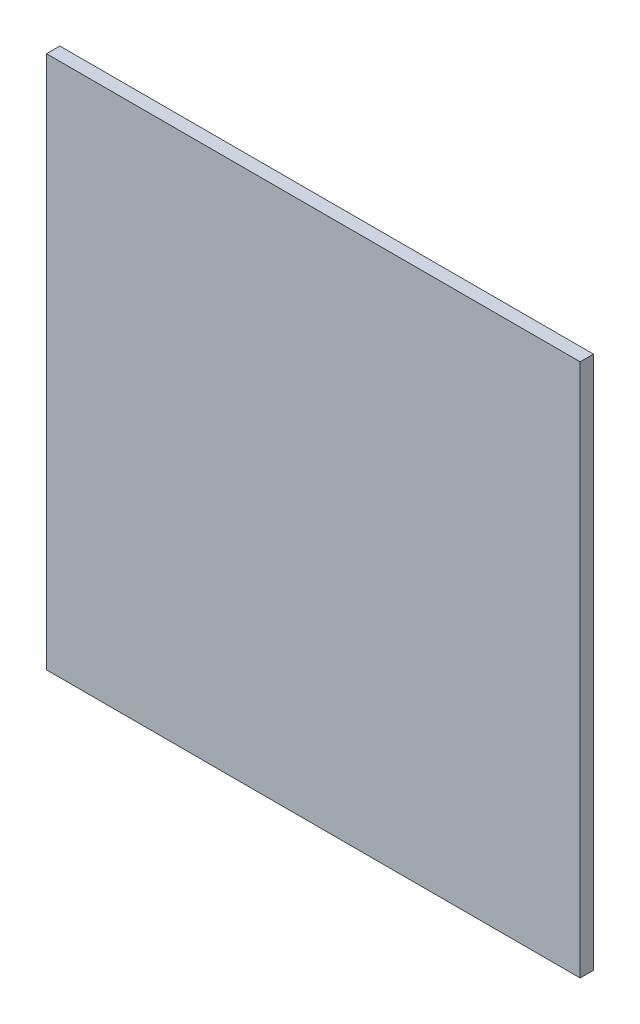
ISO-10303-21;
HEADER;
FILE_DESCRIPTION(('STEP AP214'),'2;1');
FILE_NAME('part.step','',(''),(''),'','','');
FILE_SCHEMA(('AUTOMOTIVE_DESIGN { 1 0 10303 214 1 1 1 1 }'));
ENDSEC;
DATA;
#1=APPLICATION_CONTEXT('core data for automotive mechanical design processes');
#2=APPLICATION_PROTOCOL_DEFINITION('international standard','automotive_design',2000,#1);
#3=PRODUCT_CONTEXT('',#1,'mechanical');
#4=PRODUCT('Part','Part','',(#3));
#5=PRODUCT_RELATED_PRODUCT_CATEGORY('part','',(#4));
#6=PRODUCT_DEFINITION_FORMATION('','',#4);
#7=PRODUCT_DEFINITION_CONTEXT('part definition',#1,'design');
#8=PRODUCT_DEFINITION('design','',#6,#7);
#9=PRODUCT_DEFINITION_SHAPE('','',#8);
#10=(LENGTH_UNIT() NAMED_UNIT(*) SI_UNIT(.MILLI.,.METRE.));
#11=(NAMED_UNIT(*) PLANE_ANGLE_UNIT() SI_UNIT($,.RADIAN.));
#12=(NAMED_UNIT(*) SI_UNIT($,.STERADIAN.) SOLID_ANGLE_UNIT());
#13=UNCERTAINTY_MEASURE_WITH_UNIT(LENGTH_MEASURE(1.E-05),#10,'distance_accuracy_value','');
#14=(GEOMETRIC_REPRESENTATION_CONTEXT(3) GLOBAL_UNCERTAINTY_ASSIGNED_CONTEXT((#13)) GLOBAL_UNIT_ASSIGNED_CONTEXT((#10,
#11,#12)) REPRESENTATION_CONTEXT('',''));
#15=CARTESIAN_POINT('',(0.,0.,0.));
#16=DIRECTION('',(0.,0.,1.));
#17=DIRECTION('',(1.,0.,0.));
#18=AXIS2_PLACEMENT_3D('',#15,#16,#17);
#19=CARTESIAN_POINT('',(0.,0.,10.));
#20=DIRECTION('',(1.,0.,0.));
#21=DIRECTION('',(0.,1.,0.));
#22=AXIS2_PLACEMENT_3D('',#19,#20,#21);
#23=PLANE('',#22);
#24=DIRECTION('',(0.,-1.,0.));
#25=VECTOR('',#24,1.);
#26=CARTESIAN_POINT('',(0.,0.,0.));
#27=LINE('',#26,#25);
#28=CARTESIAN_POINT('',(0.,400.,0.));
#29=VERTEX_POINT('',#28);
#30=CARTESIAN_POINT('',(0.,0.,0.));
#31=VERTEX_POINT('',#30);
#32=EDGE_CURVE('E96',#29,#31,#27,.T.);
#33=ORIENTED_EDGE('',*,*,#32,.T.);
#34=DIRECTION('',(0.,0.,-1.));
#35=VECTOR('',#34,1.);
#36=CARTESIAN_POINT('',(0.,0.,10.));
#37=LINE('',#36,#35);
#38=CARTESIAN_POINT('',(0.,0.,10.));
#39=VERTEX_POINT('',#38);
#40=EDGE_CURVE('E11',#39,#31,#37,.T.);
#41=ORIENTED_EDGE('',*,*,#40,.F.);
#42=DIRECTION('',(0.,-1.,0.));
#43=VECTOR('',#42,1.);
#44=CARTESIAN_POINT('',(0.,0.,10.));
#45=LINE('',#44,#43);
#46=CARTESIAN_POINT('',(0.,400.,10.));
#47=VERTEX_POINT('',#46);
#48=EDGE_CURVE('E84',#47,#39,#45,.T.);
#49=ORIENTED_EDGE('',*,*,#48,.F.);
#50=DIRECTION('',(0.,0.,-1.));
#51=VECTOR('',#50,1.);
#52=CARTESIAN_POINT('',(0.,400.,10.));
#53=LINE('',#52,#51);
#54=EDGE_CURVE('E92',#47,#29,#53,.T.);
#55=ORIENTED_EDGE('',*,*,#54,.T.);
#56=EDGE_LOOP('',(#33,#41,#49,#55));
#57=FACE_BOUND('',#56,.T.);
#58=ADVANCED_FACE('F33',(#57),#23,.F.);
#59=CARTESIAN_POINT('',(0.,0.,10.));
#60=DIRECTION('',(0.,1.,0.));
#61=DIRECTION('',(0.,0.,1.));
#62=AXIS2_PLACEMENT_3D('',#59,#60,#61);
#63=PLANE('',#62);
#64=DIRECTION('',(1.,0.,0.));
#65=VECTOR('',#64,1.);
#66=CARTESIAN_POINT('',(0.,0.,0.));
#67=LINE('',#66,#65);
#68=CARTESIAN_POINT('',(400.,0.,0.));
#69=VERTEX_POINT('',#68);
#70=EDGE_CURVE('E88',#31,#69,#67,.T.);
#71=ORIENTED_EDGE('',*,*,#70,.T.);
#72=DIRECTION('',(0.,0.,-1.));
#73=VECTOR('',#72,1.);
#74=CARTESIAN_POINT('',(400.,0.,10.));
#75=LINE('',#74,#73);
#76=CARTESIAN_POINT('',(400.,0.,10.));
#77=VERTEX_POINT('',#76);
#78=EDGE_CURVE('E41',#77,#69,#75,.T.);
#79=ORIENTED_EDGE('',*,*,#78,.F.);
#80=DIRECTION('',(1.,0.,0.));
#81=VECTOR('',#80,1.);
#82=CARTESIAN_POINT('',(0.,0.,10.));
#83=LINE('',#82,#81);
#84=EDGE_CURVE('E79',#39,#77,#83,.T.);
#85=ORIENTED_EDGE('',*,*,#84,.F.);
#86=ORIENTED_EDGE('',*,*,#40,.T.);
#87=EDGE_LOOP('',(#71,#79,#85,#86));
#88=FACE_BOUND('',#87,.T.);
#89=ADVANCED_FACE('F87',(#88),#63,.F.);
#90=CARTESIAN_POINT('',(400.,0.,10.));
#91=DIRECTION('',(-1.,0.,0.));
#92=DIRECTION('',(0.,-1.,0.));
#93=AXIS2_PLACEMENT_3D('',#90,#91,#92);
#94=PLANE('',#93);
#95=DIRECTION('',(0.,1.,0.));
#96=VECTOR('',#95,1.);
#97=CARTESIAN_POINT('',(400.,0.,0.));
#98=LINE('',#97,#96);
#99=CARTESIAN_POINT('',(400.,400.,0.));
#100=VERTEX_POINT('',#99);
#101=EDGE_CURVE('E66',#69,#100,#98,.T.);
#102=ORIENTED_EDGE('',*,*,#101,.T.);
#103=DIRECTION('',(0.,0.,-1.));
#104=VECTOR('',#103,1.);
#105=CARTESIAN_POINT('',(400.,400.,10.));
#106=LINE('',#105,#104);
#107=CARTESIAN_POINT('',(400.,400.,10.));
#108=VERTEX_POINT('',#107);
#109=EDGE_CURVE('E89',#108,#100,#106,.T.);
#110=ORIENTED_EDGE('',*,*,#109,.F.);
#111=DIRECTION('',(0.,1.,0.));
#112=VECTOR('',#111,1.);
#113=CARTESIAN_POINT('',(400.,0.,10.));
#114=LINE('',#113,#112);
#115=EDGE_CURVE('E82',#77,#108,#114,.T.);
#116=ORIENTED_EDGE('',*,*,#115,.F.);
#117=ORIENTED_EDGE('',*,*,#78,.T.);
#118=EDGE_LOOP('',(#102,#110,#116,#117));
#119=FACE_BOUND('',#118,.T.);
#120=ADVANCED_FACE('F90',(#119),#94,.F.);
#121=CARTESIAN_POINT('',(0.,400.,10.));
#122=DIRECTION('',(0.,-1.,0.));
#123=DIRECTION('',(0.,0.,-1.));
#124=AXIS2_PLACEMENT_3D('',#121,#122,#123);
#125=PLANE('',#124);
#126=DIRECTION('',(-1.,0.,0.));
#127=VECTOR('',#126,1.);
#128=CARTESIAN_POINT('',(0.,400.,0.));
#129=LINE('',#128,#127);
#130=EDGE_CURVE('E72',#100,#29,#129,.T.);
#131=ORIENTED_EDGE('',*,*,#130,.T.);
#132=ORIENTED_EDGE('',*,*,#54,.F.);
#133=DIRECTION('',(-1.,0.,0.));
#134=VECTOR('',#133,1.);
#135=CARTESIAN_POINT('',(0.,400.,10.));
#136=LINE('',#135,#134);
#137=EDGE_CURVE('E49',#108,#47,#136,.T.);
#138=ORIENTED_EDGE('',*,*,#137,.F.);
#139=ORIENTED_EDGE('',*,*,#109,.T.);
#140=EDGE_LOOP('',(#131,#132,#138,#139));
#141=FACE_BOUND('',#140,.T.);
#142=ADVANCED_FACE('F103',(#141),#125,.F.);
#143=CARTESIAN_POINT('',(0.,400.,10.));
#144=DIRECTION('',(0.,0.,-1.));
#145=DIRECTION('',(-1.,0.,0.));
#146=AXIS2_PLACEMENT_3D('',#143,#144,#145);
#147=PLANE('',#146);
#148=ORIENTED_EDGE('',*,*,#48,.T.);
#149=ORIENTED_EDGE('',*,*,#84,.T.);
#150=ORIENTED_EDGE('',*,*,#115,.T.);
#151=ORIENTED_EDGE('',*,*,#137,.T.);
#152=EDGE_LOOP('',(#148,#149,#150,#151));
#153=FACE_BOUND('',#152,.T.);
#154=ADVANCED_FACE('F80',(#153),#147,.F.);
#155=CARTESIAN_POINT('',(0.,400.,0.));
#156=DIRECTION('',(0.,0.,-1.));
#157=DIRECTION('',(-1.,0.,0.));
#158=AXIS2_PLACEMENT_3D('',#155,#156,#157);
#159=PLANE('',#158);
#160=ORIENTED_EDGE('',*,*,#32,.F.);
#161=ORIENTED_EDGE('',*,*,#130,.F.);
#162=ORIENTED_EDGE('',*,*,#101,.F.);
#163=ORIENTED_EDGE('',*,*,#70,.F.);
#164=EDGE_LOOP('',(#160,#161,#162,#163));
#165=FACE_BOUND('',#164,.T.);
#166=ADVANCED_FACE('F106',(#165),#159,.T.);
#167=CLOSED_SHELL('',(#58,#89,#120,#142,#154,#166));
#168=MANIFOLD_SOLID_BREP('B2',#167);
#169=ADVANCED_BREP_SHAPE_REPRESENTATION('',(#18,#168),#14);
#170=SHAPE_DEFINITION_REPRESENTATION(#9,#169);
ENDSEC;
END-ISO-10303-21;
